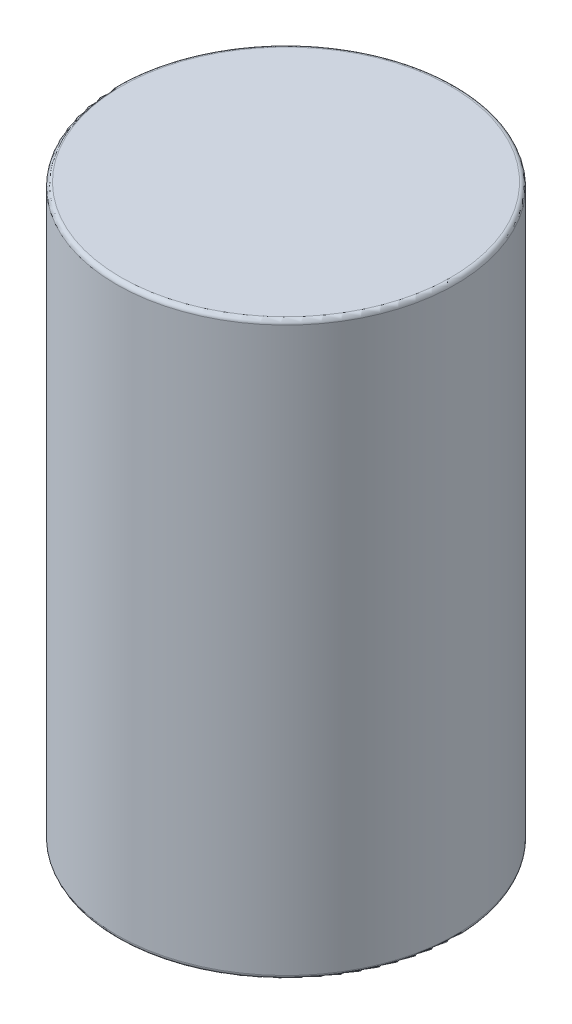
ISO-10303-21;
HEADER;
FILE_DESCRIPTION(('STEP AP214'),'2;1');
FILE_NAME('part.step','',(''),(''),'','','');
FILE_SCHEMA(('AUTOMOTIVE_DESIGN { 1 0 10303 214 1 1 1 1 }'));
ENDSEC;
DATA;
#1=APPLICATION_CONTEXT('core data for automotive mechanical design processes');
#2=APPLICATION_PROTOCOL_DEFINITION('international standard','automotive_design',2000,#1);
#3=PRODUCT_CONTEXT('',#1,'mechanical');
#4=PRODUCT('Part','Part','',(#3));
#5=PRODUCT_RELATED_PRODUCT_CATEGORY('part','',(#4));
#6=PRODUCT_DEFINITION_FORMATION('','',#4);
#7=PRODUCT_DEFINITION_CONTEXT('part definition',#1,'design');
#8=PRODUCT_DEFINITION('design','',#6,#7);
#9=PRODUCT_DEFINITION_SHAPE('','',#8);
#10=(LENGTH_UNIT() NAMED_UNIT(*) SI_UNIT(.MILLI.,.METRE.));
#11=(NAMED_UNIT(*) PLANE_ANGLE_UNIT() SI_UNIT($,.RADIAN.));
#12=(NAMED_UNIT(*) SI_UNIT($,.STERADIAN.) SOLID_ANGLE_UNIT());
#13=UNCERTAINTY_MEASURE_WITH_UNIT(LENGTH_MEASURE(1.E-05),#10,'distance_accuracy_value','');
#14=(GEOMETRIC_REPRESENTATION_CONTEXT(3) GLOBAL_UNCERTAINTY_ASSIGNED_CONTEXT((#13)) GLOBAL_UNIT_ASSIGNED_CONTEXT((#10,
#11,#12)) REPRESENTATION_CONTEXT('',''));
#15=CARTESIAN_POINT('',(0.,0.,0.));
#16=DIRECTION('',(0.,0.,1.));
#17=DIRECTION('',(1.,0.,0.));
#18=AXIS2_PLACEMENT_3D('',#15,#16,#17);
#19=CARTESIAN_POINT('',(0.,13.5,0.));
#20=DIRECTION('',(0.,-1.,0.));
#21=DIRECTION('',(0.,0.,-1.));
#22=AXIS2_PLACEMENT_3D('',#19,#20,#21);
#23=CYLINDRICAL_SURFACE('',#22,4.);
#24=CARTESIAN_POINT('',(0.,0.0999999999999994,0.));
#25=DIRECTION('',(0.,1.,0.));
#26=DIRECTION('',(0.,0.,1.));
#27=AXIS2_PLACEMENT_3D('',#24,#25,#26);
#28=CIRCLE('',#27,4.);
#29=CARTESIAN_POINT('',(0.,0.0999999999999994,4.));
#30=VERTEX_POINT('',#29);
#31=EDGE_CURVE('E40',#30,#30,#28,.T.);
#32=ORIENTED_EDGE('',*,*,#31,.T.);
#33=EDGE_LOOP('',(#32));
#34=FACE_BOUND('',#33,.T.);
#35=CARTESIAN_POINT('',(0.,13.4,0.));
#36=DIRECTION('',(0.,1.,0.));
#37=DIRECTION('',(0.,0.,1.));
#38=AXIS2_PLACEMENT_3D('',#35,#36,#37);
#39=CIRCLE('',#38,4.);
#40=CARTESIAN_POINT('',(0.,13.4,4.));
#41=VERTEX_POINT('',#40);
#42=EDGE_CURVE('E44',#41,#41,#39,.F.);
#43=ORIENTED_EDGE('',*,*,#42,.T.);
#44=EDGE_LOOP('',(#43));
#45=FACE_BOUND('',#44,.T.);
#46=ADVANCED_FACE('F33',(#34,#45),#23,.T.);
#47=CARTESIAN_POINT('',(0.,13.5,0.));
#48=DIRECTION('',(0.,1.,0.));
#49=DIRECTION('',(0.,0.,1.));
#50=AXIS2_PLACEMENT_3D('',#47,#48,#49);
#51=PLANE('',#50);
#52=CARTESIAN_POINT('',(0.,13.5,0.));
#53=DIRECTION('',(0.,1.,0.));
#54=DIRECTION('',(0.,0.,1.));
#55=AXIS2_PLACEMENT_3D('',#52,#53,#54);
#56=CIRCLE('',#55,3.9);
#57=CARTESIAN_POINT('',(0.,13.5,3.9));
#58=VERTEX_POINT('',#57);
#59=EDGE_CURVE('E48',#58,#58,#56,.T.);
#60=ORIENTED_EDGE('',*,*,#59,.T.);
#61=EDGE_LOOP('',(#60));
#62=FACE_BOUND('',#61,.T.);
#63=ADVANCED_FACE('F54',(#62),#51,.T.);
#64=CARTESIAN_POINT('',(0.,0.,0.));
#65=DIRECTION('',(0.,1.,0.));
#66=DIRECTION('',(0.,0.,1.));
#67=AXIS2_PLACEMENT_3D('',#64,#65,#66);
#68=PLANE('',#67);
#69=CARTESIAN_POINT('',(0.,0.,0.));
#70=DIRECTION('',(0.,1.,0.));
#71=DIRECTION('',(0.,0.,1.));
#72=AXIS2_PLACEMENT_3D('',#69,#70,#71);
#73=CIRCLE('',#72,3.9);
#74=CARTESIAN_POINT('',(0.,0.,3.9));
#75=VERTEX_POINT('',#74);
#76=EDGE_CURVE('E10',#75,#75,#73,.F.);
#77=ORIENTED_EDGE('',*,*,#76,.T.);
#78=EDGE_LOOP('',(#77));
#79=FACE_BOUND('',#78,.T.);
#80=ADVANCED_FACE('F58',(#79),#68,.F.);
#81=CARTESIAN_POINT('',(0.,13.4,0.));
#82=DIRECTION('',(0.,1.,0.));
#83=DIRECTION('',(0.,0.,1.));
#84=AXIS2_PLACEMENT_3D('',#81,#82,#83);
#85=TOROIDAL_SURFACE('',#84,3.9,0.1);
#86=ORIENTED_EDGE('',*,*,#42,.F.);
#87=EDGE_LOOP('',(#86));
#88=FACE_BOUND('',#87,.T.);
#89=ORIENTED_EDGE('',*,*,#59,.F.);
#90=EDGE_LOOP('',(#89));
#91=FACE_BOUND('',#90,.T.);
#92=ADVANCED_FACE('F56',(#88,#91),#85,.T.);
#93=CARTESIAN_POINT('',(0.,0.0999999999999994,0.));
#94=DIRECTION('',(0.,1.,0.));
#95=DIRECTION('',(0.,0.,1.));
#96=AXIS2_PLACEMENT_3D('',#93,#94,#95);
#97=TOROIDAL_SURFACE('',#96,3.9,0.1);
#98=ORIENTED_EDGE('',*,*,#76,.F.);
#99=EDGE_LOOP('',(#98));
#100=FACE_BOUND('',#99,.T.);
#101=ORIENTED_EDGE('',*,*,#31,.F.);
#102=EDGE_LOOP('',(#101));
#103=FACE_BOUND('',#102,.T.);
#104=ADVANCED_FACE('F35',(#100,#103),#97,.T.);
#105=CLOSED_SHELL('',(#46,#63,#80,#92,#104));
#106=MANIFOLD_SOLID_BREP('B2',#105);
#107=ADVANCED_BREP_SHAPE_REPRESENTATION('',(#18,#106),#14);
#108=SHAPE_DEFINITION_REPRESENTATION(#9,#107);
ENDSEC;
END-ISO-10303-21;
